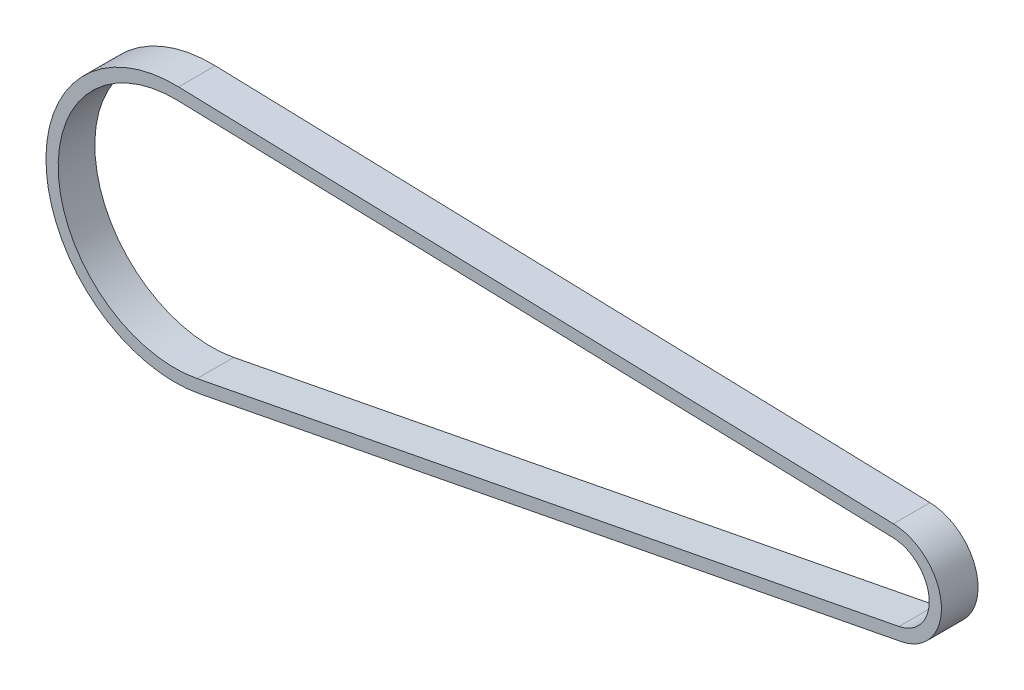
ISO-10303-21;
HEADER;
FILE_DESCRIPTION(('STEP AP214'),'2;1');
FILE_NAME('part.step','',(''),(''),'','','');
FILE_SCHEMA(('AUTOMOTIVE_DESIGN { 1 0 10303 214 1 1 1 1 }'));
ENDSEC;
DATA;
#1=APPLICATION_CONTEXT('core data for automotive mechanical design processes');
#2=APPLICATION_PROTOCOL_DEFINITION('international standard','automotive_design',2000,#1);
#3=PRODUCT_CONTEXT('',#1,'mechanical');
#4=PRODUCT('Part','Part','',(#3));
#5=PRODUCT_RELATED_PRODUCT_CATEGORY('part','',(#4));
#6=PRODUCT_DEFINITION_FORMATION('','',#4);
#7=PRODUCT_DEFINITION_CONTEXT('part definition',#1,'design');
#8=PRODUCT_DEFINITION('design','',#6,#7);
#9=PRODUCT_DEFINITION_SHAPE('','',#8);
#10=(LENGTH_UNIT() NAMED_UNIT(*) SI_UNIT(.MILLI.,.METRE.));
#11=(NAMED_UNIT(*) PLANE_ANGLE_UNIT() SI_UNIT($,.RADIAN.));
#12=(NAMED_UNIT(*) SI_UNIT($,.STERADIAN.) SOLID_ANGLE_UNIT());
#13=UNCERTAINTY_MEASURE_WITH_UNIT(LENGTH_MEASURE(1.E-05),#10,'distance_accuracy_value','');
#14=(GEOMETRIC_REPRESENTATION_CONTEXT(3) GLOBAL_UNCERTAINTY_ASSIGNED_CONTEXT((#13)) GLOBAL_UNIT_ASSIGNED_CONTEXT((#10,
#11,#12)) REPRESENTATION_CONTEXT('',''));
#15=CARTESIAN_POINT('',(0.,0.,0.));
#16=DIRECTION('',(0.,0.,1.));
#17=DIRECTION('',(1.,0.,0.));
#18=AXIS2_PLACEMENT_3D('',#15,#16,#17);
#19=CARTESIAN_POINT('',(0.,0.,6.));
#20=DIRECTION('',(0.,0.,1.));
#21=DIRECTION('',(1.,0.,0.));
#22=AXIS2_PLACEMENT_3D('',#19,#20,#21);
#23=PLANE('',#22);
#24=CARTESIAN_POINT('',(0.,0.,6.));
#25=DIRECTION('',(0.,0.,1.));
#26=DIRECTION('',(1.,0.,0.));
#27=AXIS2_PLACEMENT_3D('',#24,#25,#26);
#28=CIRCLE('',#27,21.11);
#29=CARTESIAN_POINT('',(0.619044098545484,21.1009214112573,6.));
#30=VERTEX_POINT('',#29);
#31=CARTESIAN_POINT('',(4.02288461801242,-20.7231392252757,6.));
#32=VERTEX_POINT('',#31);
#33=EDGE_CURVE('E153',#30,#32,#28,.T.);
#34=ORIENTED_EDGE('',*,*,#33,.T.);
#35=DIRECTION('',(0.981674051410501,0.19056772231229,0.));
#36=VECTOR('',#35,1.);
#37=CARTESIAN_POINT('',(119.007144019853,1.59820907204354,6.));
#38=LINE('',#37,#36);
#39=CARTESIAN_POINT('',(119.007144019853,1.59820907204355,6.));
#40=VERTEX_POINT('',#39);
#41=EDGE_CURVE('E157',#32,#40,#38,.T.);
#42=ORIENTED_EDGE('',*,*,#41,.T.);
#43=CARTESIAN_POINT('',(117.4616397919,9.5595856289827,6.));
#44=DIRECTION('',(0.,0.,1.));
#45=DIRECTION('',(1.,0.,0.));
#46=AXIS2_PLACEMENT_3D('',#43,#44,#45);
#47=CIRCLE('',#46,8.11);
#48=CARTESIAN_POINT('',(117.699462986557,17.6660978338759,6.));
#49=VERTEX_POINT('',#48);
#50=EDGE_CURVE('E161',#40,#49,#47,.T.);
#51=ORIENTED_EDGE('',*,*,#50,.T.);
#52=DIRECTION('',(-0.999569938951079,0.0293246849145185,0.));
#53=VECTOR('',#52,1.);
#54=CARTESIAN_POINT('',(0.619044098545484,21.1009214112573,6.));
#55=LINE('',#54,#53);
#56=EDGE_CURVE('E164',#49,#30,#55,.T.);
#57=ORIENTED_EDGE('',*,*,#56,.T.);
#58=EDGE_LOOP('',(#34,#42,#51,#57));
#59=FACE_BOUND('',#58,.T.);
#60=DIRECTION('',(0.981674051410501,0.190567722312289,0.));
#61=VECTOR('',#60,1.);
#62=CARTESIAN_POINT('',(118.626008575228,3.56155717486454,6.));
#63=LINE('',#62,#61);
#64=CARTESIAN_POINT('',(3.64174917338785,-18.7597911224547,6.));
#65=VERTEX_POINT('',#64);
#66=CARTESIAN_POINT('',(118.626008575228,3.56155717486454,6.));
#67=VERTEX_POINT('',#66);
#68=EDGE_CURVE('E114',#65,#67,#63,.T.);
#69=ORIENTED_EDGE('',*,*,#68,.F.);
#70=CARTESIAN_POINT('',(0.,0.,6.));
#71=DIRECTION('',(0.,0.,1.));
#72=DIRECTION('',(1.,0.,0.));
#73=AXIS2_PLACEMENT_3D('',#70,#71,#72);
#74=CIRCLE('',#73,19.11);
#75=CARTESIAN_POINT('',(0.560394728716457,19.1017815333551,6.));
#76=VERTEX_POINT('',#75);
#77=EDGE_CURVE('E105',#76,#65,#74,.T.);
#78=ORIENTED_EDGE('',*,*,#77,.F.);
#79=DIRECTION('',(-0.999569938951079,0.0293246849145185,0.));
#80=VECTOR('',#79,1.);
#81=CARTESIAN_POINT('',(0.560394728716457,19.1017815333551,6.));
#82=LINE('',#81,#80);
#83=CARTESIAN_POINT('',(117.640813616728,15.6669579559738,6.));
#84=VERTEX_POINT('',#83);
#85=EDGE_CURVE('E131',#84,#76,#82,.T.);
#86=ORIENTED_EDGE('',*,*,#85,.F.);
#87=CARTESIAN_POINT('',(117.4616397919,9.5595856289827,6.));
#88=DIRECTION('',(0.,0.,1.));
#89=DIRECTION('',(1.,0.,0.));
#90=AXIS2_PLACEMENT_3D('',#87,#88,#89);
#91=CIRCLE('',#90,6.11);
#92=EDGE_CURVE('E127',#67,#84,#91,.T.);
#93=ORIENTED_EDGE('',*,*,#92,.F.);
#94=EDGE_LOOP('',(#69,#78,#86,#93));
#95=FACE_BOUND('',#94,.T.);
#96=ADVANCED_FACE('F39',(#59,#95),#23,.T.);
#97=CARTESIAN_POINT('',(0.,0.,0.));
#98=DIRECTION('',(0.,0.,1.));
#99=DIRECTION('',(1.,0.,0.));
#100=AXIS2_PLACEMENT_3D('',#97,#98,#99);
#101=PLANE('',#100);
#102=CARTESIAN_POINT('',(0.,0.,0.));
#103=DIRECTION('',(0.,0.,1.));
#104=DIRECTION('',(1.,0.,0.));
#105=AXIS2_PLACEMENT_3D('',#102,#103,#104);
#106=CIRCLE('',#105,21.11);
#107=CARTESIAN_POINT('',(0.619044098545484,21.1009214112573,0.));
#108=VERTEX_POINT('',#107);
#109=CARTESIAN_POINT('',(4.02288461801242,-20.7231392252757,0.));
#110=VERTEX_POINT('',#109);
#111=EDGE_CURVE('E123',#108,#110,#106,.T.);
#112=ORIENTED_EDGE('',*,*,#111,.F.);
#113=DIRECTION('',(-0.999569938951079,0.0293246849145185,0.));
#114=VECTOR('',#113,1.);
#115=CARTESIAN_POINT('',(0.619044098545484,21.1009214112573,0.));
#116=LINE('',#115,#114);
#117=CARTESIAN_POINT('',(117.699462986557,17.6660978338759,0.));
#118=VERTEX_POINT('',#117);
#119=EDGE_CURVE('E158',#118,#108,#116,.T.);
#120=ORIENTED_EDGE('',*,*,#119,.F.);
#121=CARTESIAN_POINT('',(117.4616397919,9.5595856289827,0.));
#122=DIRECTION('',(0.,0.,1.));
#123=DIRECTION('',(1.,0.,0.));
#124=AXIS2_PLACEMENT_3D('',#121,#122,#123);
#125=CIRCLE('',#124,8.11);
#126=CARTESIAN_POINT('',(119.007144019853,1.59820907204355,0.));
#127=VERTEX_POINT('',#126);
#128=EDGE_CURVE('E174',#127,#118,#125,.T.);
#129=ORIENTED_EDGE('',*,*,#128,.F.);
#130=DIRECTION('',(0.981674051410501,0.19056772231229,0.));
#131=VECTOR('',#130,1.);
#132=CARTESIAN_POINT('',(119.007144019853,1.59820907204354,0.));
#133=LINE('',#132,#131);
#134=EDGE_CURVE('E171',#110,#127,#133,.T.);
#135=ORIENTED_EDGE('',*,*,#134,.F.);
#136=EDGE_LOOP('',(#112,#120,#129,#135));
#137=FACE_BOUND('',#136,.T.);
#138=CARTESIAN_POINT('',(0.,0.,0.));
#139=DIRECTION('',(0.,0.,1.));
#140=DIRECTION('',(1.,0.,0.));
#141=AXIS2_PLACEMENT_3D('',#138,#139,#140);
#142=CIRCLE('',#141,19.11);
#143=CARTESIAN_POINT('',(0.560394728716457,19.1017815333551,0.));
#144=VERTEX_POINT('',#143);
#145=CARTESIAN_POINT('',(3.64174917338785,-18.7597911224547,0.));
#146=VERTEX_POINT('',#145);
#147=EDGE_CURVE('E63',#144,#146,#142,.T.);
#148=ORIENTED_EDGE('',*,*,#147,.T.);
#149=DIRECTION('',(0.981674051410501,0.190567722312289,0.));
#150=VECTOR('',#149,1.);
#151=CARTESIAN_POINT('',(118.626008575228,3.56155717486454,0.));
#152=LINE('',#151,#150);
#153=CARTESIAN_POINT('',(118.626008575228,3.56155717486454,0.));
#154=VERTEX_POINT('',#153);
#155=EDGE_CURVE('E121',#146,#154,#152,.T.);
#156=ORIENTED_EDGE('',*,*,#155,.T.);
#157=CARTESIAN_POINT('',(117.4616397919,9.5595856289827,0.));
#158=DIRECTION('',(0.,0.,1.));
#159=DIRECTION('',(1.,0.,0.));
#160=AXIS2_PLACEMENT_3D('',#157,#158,#159);
#161=CIRCLE('',#160,6.11);
#162=CARTESIAN_POINT('',(117.640813616728,15.6669579559738,0.));
#163=VERTEX_POINT('',#162);
#164=EDGE_CURVE('E140',#154,#163,#161,.T.);
#165=ORIENTED_EDGE('',*,*,#164,.T.);
#166=DIRECTION('',(-0.999569938951079,0.0293246849145185,0.));
#167=VECTOR('',#166,1.);
#168=CARTESIAN_POINT('',(0.560394728716457,19.1017815333551,0.));
#169=LINE('',#168,#167);
#170=EDGE_CURVE('E115',#163,#144,#169,.T.);
#171=ORIENTED_EDGE('',*,*,#170,.T.);
#172=EDGE_LOOP('',(#148,#156,#165,#171));
#173=FACE_BOUND('',#172,.T.);
#174=ADVANCED_FACE('F197',(#137,#173),#101,.F.);
#175=CARTESIAN_POINT('',(0.,0.,6.));
#176=DIRECTION('',(0.,0.,-1.));
#177=DIRECTION('',(-1.,0.,0.));
#178=AXIS2_PLACEMENT_3D('',#175,#176,#177);
#179=CYLINDRICAL_SURFACE('',#178,21.11);
#180=ORIENTED_EDGE('',*,*,#111,.T.);
#181=DIRECTION('',(0.,0.,-1.));
#182=VECTOR('',#181,1.);
#183=CARTESIAN_POINT('',(4.02288461801242,-20.7231392252757,6.));
#184=LINE('',#183,#182);
#185=EDGE_CURVE('E11',#32,#110,#184,.T.);
#186=ORIENTED_EDGE('',*,*,#185,.F.);
#187=ORIENTED_EDGE('',*,*,#33,.F.);
#188=DIRECTION('',(0.,0.,-1.));
#189=VECTOR('',#188,1.);
#190=CARTESIAN_POINT('',(0.619044098545484,21.1009214112573,6.));
#191=LINE('',#190,#189);
#192=EDGE_CURVE('E167',#30,#108,#191,.T.);
#193=ORIENTED_EDGE('',*,*,#192,.T.);
#194=EDGE_LOOP('',(#180,#186,#187,#193));
#195=FACE_BOUND('',#194,.T.);
#196=ADVANCED_FACE('F41',(#195),#179,.T.);
#197=CARTESIAN_POINT('',(119.007144019853,1.59820907204354,6.));
#198=DIRECTION('',(-0.19056772231229,0.9816740514105,0.));
#199=DIRECTION('',(-0.981674051410501,-0.19056772231229,0.));
#200=AXIS2_PLACEMENT_3D('',#197,#198,#199);
#201=PLANE('',#200);
#202=ORIENTED_EDGE('',*,*,#134,.T.);
#203=DIRECTION('',(0.,0.,-1.));
#204=VECTOR('',#203,1.);
#205=CARTESIAN_POINT('',(119.007144019853,1.59820907204355,6.));
#206=LINE('',#205,#204);
#207=EDGE_CURVE('E48',#40,#127,#206,.T.);
#208=ORIENTED_EDGE('',*,*,#207,.F.);
#209=ORIENTED_EDGE('',*,*,#41,.F.);
#210=ORIENTED_EDGE('',*,*,#185,.T.);
#211=EDGE_LOOP('',(#202,#208,#209,#210));
#212=FACE_BOUND('',#211,.T.);
#213=ADVANCED_FACE('F207',(#212),#201,.F.);
#214=CARTESIAN_POINT('',(117.4616397919,9.5595856289827,6.));
#215=DIRECTION('',(0.,0.,-1.));
#216=DIRECTION('',(-1.,0.,0.));
#217=AXIS2_PLACEMENT_3D('',#214,#215,#216);
#218=CYLINDRICAL_SURFACE('',#217,8.11);
#219=ORIENTED_EDGE('',*,*,#128,.T.);
#220=DIRECTION('',(0.,0.,-1.));
#221=VECTOR('',#220,1.);
#222=CARTESIAN_POINT('',(117.699462986557,17.6660978338759,6.));
#223=LINE('',#222,#221);
#224=EDGE_CURVE('E182',#49,#118,#223,.T.);
#225=ORIENTED_EDGE('',*,*,#224,.F.);
#226=ORIENTED_EDGE('',*,*,#50,.F.);
#227=ORIENTED_EDGE('',*,*,#207,.T.);
#228=EDGE_LOOP('',(#219,#225,#226,#227));
#229=FACE_BOUND('',#228,.T.);
#230=ADVANCED_FACE('F191',(#229),#218,.T.);
#231=CARTESIAN_POINT('',(0.619044098545484,21.1009214112573,6.));
#232=DIRECTION('',(-0.0293246849145186,-0.999569938951079,0.));
#233=DIRECTION('',(0.999569938951079,-0.0293246849145186,0.));
#234=AXIS2_PLACEMENT_3D('',#231,#232,#233);
#235=PLANE('',#234);
#236=ORIENTED_EDGE('',*,*,#119,.T.);
#237=ORIENTED_EDGE('',*,*,#192,.F.);
#238=ORIENTED_EDGE('',*,*,#56,.F.);
#239=ORIENTED_EDGE('',*,*,#224,.T.);
#240=EDGE_LOOP('',(#236,#237,#238,#239));
#241=FACE_BOUND('',#240,.T.);
#242=ADVANCED_FACE('F201',(#241),#235,.F.);
#243=CARTESIAN_POINT('',(0.,0.,6.));
#244=DIRECTION('',(0.,0.,-1.));
#245=DIRECTION('',(-1.,0.,0.));
#246=AXIS2_PLACEMENT_3D('',#243,#244,#245);
#247=CYLINDRICAL_SURFACE('',#246,19.11);
#248=ORIENTED_EDGE('',*,*,#147,.F.);
#249=DIRECTION('',(0.,0.,-1.));
#250=VECTOR('',#249,1.);
#251=CARTESIAN_POINT('',(0.560394728716457,19.1017815333551,6.));
#252=LINE('',#251,#250);
#253=EDGE_CURVE('E109',#76,#144,#252,.T.);
#254=ORIENTED_EDGE('',*,*,#253,.F.);
#255=ORIENTED_EDGE('',*,*,#77,.T.);
#256=DIRECTION('',(0.,0.,-1.));
#257=VECTOR('',#256,1.);
#258=CARTESIAN_POINT('',(3.64174917338785,-18.7597911224547,6.));
#259=LINE('',#258,#257);
#260=EDGE_CURVE('E108',#65,#146,#259,.T.);
#261=ORIENTED_EDGE('',*,*,#260,.T.);
#262=EDGE_LOOP('',(#248,#254,#255,#261));
#263=FACE_BOUND('',#262,.T.);
#264=ADVANCED_FACE('F107',(#263),#247,.F.);
#265=CARTESIAN_POINT('',(118.626008575228,3.56155717486454,6.));
#266=DIRECTION('',(-0.190567722312289,0.9816740514105,0.));
#267=DIRECTION('',(-0.981674051410501,-0.190567722312289,0.));
#268=AXIS2_PLACEMENT_3D('',#265,#266,#267);
#269=PLANE('',#268);
#270=ORIENTED_EDGE('',*,*,#155,.F.);
#271=ORIENTED_EDGE('',*,*,#260,.F.);
#272=ORIENTED_EDGE('',*,*,#68,.T.);
#273=DIRECTION('',(0.,0.,-1.));
#274=VECTOR('',#273,1.);
#275=CARTESIAN_POINT('',(118.626008575228,3.56155717486454,6.));
#276=LINE('',#275,#274);
#277=EDGE_CURVE('E124',#67,#154,#276,.T.);
#278=ORIENTED_EDGE('',*,*,#277,.T.);
#279=EDGE_LOOP('',(#270,#271,#272,#278));
#280=FACE_BOUND('',#279,.T.);
#281=ADVANCED_FACE('F118',(#280),#269,.T.);
#282=CARTESIAN_POINT('',(117.4616397919,9.5595856289827,6.));
#283=DIRECTION('',(0.,0.,-1.));
#284=DIRECTION('',(-1.,0.,0.));
#285=AXIS2_PLACEMENT_3D('',#282,#283,#284);
#286=CYLINDRICAL_SURFACE('',#285,6.11);
#287=ORIENTED_EDGE('',*,*,#164,.F.);
#288=ORIENTED_EDGE('',*,*,#277,.F.);
#289=ORIENTED_EDGE('',*,*,#92,.T.);
#290=DIRECTION('',(0.,0.,-1.));
#291=VECTOR('',#290,1.);
#292=CARTESIAN_POINT('',(117.640813616728,15.6669579559738,6.));
#293=LINE('',#292,#291);
#294=EDGE_CURVE('E55',#84,#163,#293,.T.);
#295=ORIENTED_EDGE('',*,*,#294,.T.);
#296=EDGE_LOOP('',(#287,#288,#289,#295));
#297=FACE_BOUND('',#296,.T.);
#298=ADVANCED_FACE('F230',(#297),#286,.F.);
#299=CARTESIAN_POINT('',(0.560394728716457,19.1017815333551,6.));
#300=DIRECTION('',(-0.0293246849145185,-0.999569938951079,0.));
#301=DIRECTION('',(0.999569938951079,-0.0293246849145185,0.));
#302=AXIS2_PLACEMENT_3D('',#299,#300,#301);
#303=PLANE('',#302);
#304=ORIENTED_EDGE('',*,*,#170,.F.);
#305=ORIENTED_EDGE('',*,*,#294,.F.);
#306=ORIENTED_EDGE('',*,*,#85,.T.);
#307=ORIENTED_EDGE('',*,*,#253,.T.);
#308=EDGE_LOOP('',(#304,#305,#306,#307));
#309=FACE_BOUND('',#308,.T.);
#310=ADVANCED_FACE('F234',(#309),#303,.T.);
#311=CLOSED_SHELL('',(#96,#174,#196,#213,#230,#242,#264,#281,#298,#310));
#312=MANIFOLD_SOLID_BREP('B2',#311);
#313=ADVANCED_BREP_SHAPE_REPRESENTATION('',(#18,#312),#14);
#314=SHAPE_DEFINITION_REPRESENTATION(#9,#313);
ENDSEC;
END-ISO-10303-21;
